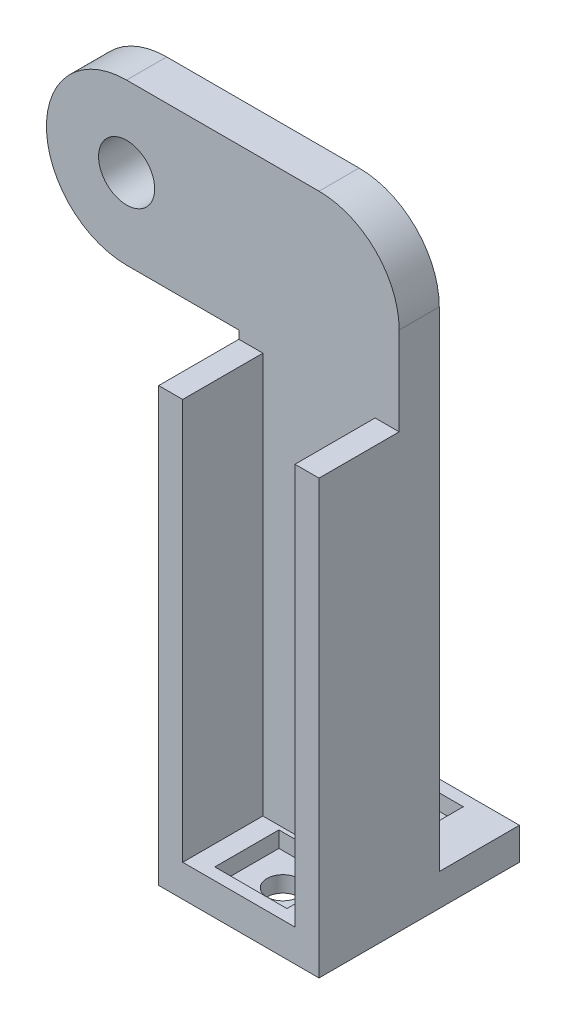
ISO-10303-21;
HEADER;
FILE_DESCRIPTION(('STEP AP214'),'2;1');
FILE_NAME('part.step','',(''),(''),'','','');
FILE_SCHEMA(('AUTOMOTIVE_DESIGN { 1 0 10303 214 1 1 1 1 }'));
ENDSEC;
DATA;
#1=APPLICATION_CONTEXT('core data for automotive mechanical design processes');
#2=APPLICATION_PROTOCOL_DEFINITION('international standard','automotive_design',2000,#1);
#3=PRODUCT_CONTEXT('',#1,'mechanical');
#4=PRODUCT('Part','Part','',(#3));
#5=PRODUCT_RELATED_PRODUCT_CATEGORY('part','',(#4));
#6=PRODUCT_DEFINITION_FORMATION('','',#4);
#7=PRODUCT_DEFINITION_CONTEXT('part definition',#1,'design');
#8=PRODUCT_DEFINITION('design','',#6,#7);
#9=PRODUCT_DEFINITION_SHAPE('','',#8);
#10=(LENGTH_UNIT() NAMED_UNIT(*) SI_UNIT(.MILLI.,.METRE.));
#11=(NAMED_UNIT(*) PLANE_ANGLE_UNIT() SI_UNIT($,.RADIAN.));
#12=(NAMED_UNIT(*) SI_UNIT($,.STERADIAN.) SOLID_ANGLE_UNIT());
#13=UNCERTAINTY_MEASURE_WITH_UNIT(LENGTH_MEASURE(1.E-05),#10,'distance_accuracy_value','');
#14=(GEOMETRIC_REPRESENTATION_CONTEXT(3) GLOBAL_UNCERTAINTY_ASSIGNED_CONTEXT((#13)) GLOBAL_UNIT_ASSIGNED_CONTEXT((#10,
#11,#12)) REPRESENTATION_CONTEXT('',''));
#15=CARTESIAN_POINT('',(0.,0.,0.));
#16=DIRECTION('',(0.,0.,1.));
#17=DIRECTION('',(1.,0.,0.));
#18=AXIS2_PLACEMENT_3D('',#15,#16,#17);
#19=CARTESIAN_POINT('',(0.,0.,2.5));
#20=DIRECTION('',(0.,0.,1.));
#21=DIRECTION('',(1.,0.,0.));
#22=AXIS2_PLACEMENT_3D('',#19,#20,#21);
#23=PLANE('',#22);
#24=DIRECTION('',(0.,-1.,0.));
#25=VECTOR('',#24,1.);
#26=CARTESIAN_POINT('',(3.5,27.,2.5));
#27=LINE('',#26,#25);
#28=CARTESIAN_POINT('',(3.5,27.,2.5));
#29=VERTEX_POINT('',#28);
#30=CARTESIAN_POINT('',(3.5,2.,2.5));
#31=VERTEX_POINT('',#30);
#32=EDGE_CURVE('E58',#29,#31,#27,.T.);
#33=ORIENTED_EDGE('',*,*,#32,.F.);
#34=DIRECTION('',(1.,0.,0.));
#35=VECTOR('',#34,1.);
#36=CARTESIAN_POINT('',(5.,27.,2.5));
#37=LINE('',#36,#35);
#38=CARTESIAN_POINT('',(5.,27.,2.5));
#39=VERTEX_POINT('',#38);
#40=EDGE_CURVE('E211',#29,#39,#37,.T.);
#41=ORIENTED_EDGE('',*,*,#40,.T.);
#42=DIRECTION('',(0.,1.,0.));
#43=VECTOR('',#42,1.);
#44=CARTESIAN_POINT('',(5.,0.,2.5));
#45=LINE('',#44,#43);
#46=CARTESIAN_POINT('',(5.,32.5,2.5));
#47=VERTEX_POINT('',#46);
#48=EDGE_CURVE('E340',#39,#47,#45,.T.);
#49=ORIENTED_EDGE('',*,*,#48,.T.);
#50=CARTESIAN_POINT('',(0.,32.5,2.5));
#51=DIRECTION('',(0.,0.,1.));
#52=DIRECTION('',(1.,0.,0.));
#53=AXIS2_PLACEMENT_3D('',#50,#51,#52);
#54=CIRCLE('',#53,5.);
#55=CARTESIAN_POINT('',(0.,37.5,2.5));
#56=VERTEX_POINT('',#55);
#57=EDGE_CURVE('E342',#47,#56,#54,.T.);
#58=ORIENTED_EDGE('',*,*,#57,.T.);
#59=DIRECTION('',(-1.,0.,0.));
#60=VECTOR('',#59,1.);
#61=CARTESIAN_POINT('',(0.,37.5,2.5));
#62=LINE('',#61,#60);
#63=CARTESIAN_POINT('',(-12.,37.5,2.5));
#64=VERTEX_POINT('',#63);
#65=EDGE_CURVE('E345',#56,#64,#62,.T.);
#66=ORIENTED_EDGE('',*,*,#65,.T.);
#67=CARTESIAN_POINT('',(-12.,32.5,2.5));
#68=DIRECTION('',(0.,0.,1.));
#69=DIRECTION('',(1.,0.,0.));
#70=AXIS2_PLACEMENT_3D('',#67,#68,#69);
#71=CIRCLE('',#70,5.);
#72=CARTESIAN_POINT('',(-12.,27.5,2.5));
#73=VERTEX_POINT('',#72);
#74=EDGE_CURVE('E347',#64,#73,#71,.T.);
#75=ORIENTED_EDGE('',*,*,#74,.T.);
#76=DIRECTION('',(-1.,0.,0.));
#77=VECTOR('',#76,1.);
#78=CARTESIAN_POINT('',(0.,27.5,2.5));
#79=LINE('',#78,#77);
#80=CARTESIAN_POINT('',(-5.,27.5,2.5));
#81=VERTEX_POINT('',#80);
#82=EDGE_CURVE('E349',#81,#73,#79,.T.);
#83=ORIENTED_EDGE('',*,*,#82,.F.);
#84=DIRECTION('',(0.,1.,0.));
#85=VECTOR('',#84,1.);
#86=CARTESIAN_POINT('',(-5.,0.,2.5));
#87=LINE('',#86,#85);
#88=CARTESIAN_POINT('',(-5.,27.,2.5));
#89=VERTEX_POINT('',#88);
#90=EDGE_CURVE('E352',#89,#81,#87,.T.);
#91=ORIENTED_EDGE('',*,*,#90,.F.);
#92=DIRECTION('',(-1.,0.,0.));
#93=VECTOR('',#92,1.);
#94=CARTESIAN_POINT('',(-5.,27.,2.5));
#95=LINE('',#94,#93);
#96=CARTESIAN_POINT('',(-3.5,27.,2.5));
#97=VERTEX_POINT('',#96);
#98=EDGE_CURVE('E233',#97,#89,#95,.T.);
#99=ORIENTED_EDGE('',*,*,#98,.F.);
#100=DIRECTION('',(0.,-1.,0.));
#101=VECTOR('',#100,1.);
#102=CARTESIAN_POINT('',(-3.5,27.,2.5));
#103=LINE('',#102,#101);
#104=CARTESIAN_POINT('',(-3.5,2.,2.5));
#105=VERTEX_POINT('',#104);
#106=EDGE_CURVE('E236',#97,#105,#103,.T.);
#107=ORIENTED_EDGE('',*,*,#106,.T.);
#108=DIRECTION('',(1.,0.,0.));
#109=VECTOR('',#108,1.);
#110=CARTESIAN_POINT('',(0.,2.,2.5));
#111=LINE('',#110,#109);
#112=EDGE_CURVE('E335',#105,#31,#111,.T.);
#113=ORIENTED_EDGE('',*,*,#112,.T.);
#114=EDGE_LOOP('',(#33,#41,#49,#58,#66,#75,#83,#91,#99,#107,#113));
#115=FACE_BOUND('',#114,.T.);
#116=CARTESIAN_POINT('',(-12.,32.5,2.5));
#117=DIRECTION('',(0.,0.,1.));
#118=DIRECTION('',(1.,0.,0.));
#119=AXIS2_PLACEMENT_3D('',#116,#117,#118);
#120=CIRCLE('',#119,1.75);
#121=CARTESIAN_POINT('',(-10.25,32.5,2.5));
#122=VERTEX_POINT('',#121);
#123=EDGE_CURVE('E354',#122,#122,#120,.T.);
#124=ORIENTED_EDGE('',*,*,#123,.F.);
#125=EDGE_LOOP('',(#124));
#126=FACE_BOUND('',#125,.T.);
#127=ADVANCED_FACE('F41',(#115,#126),#23,.T.);
#128=CARTESIAN_POINT('',(0.,2.,-5.));
#129=DIRECTION('',(0.,-1.,0.));
#130=DIRECTION('',(0.,0.,-1.));
#131=AXIS2_PLACEMENT_3D('',#128,#129,#130);
#132=PLANE('',#131);
#133=DIRECTION('',(-1.,0.,0.));
#134=VECTOR('',#133,1.);
#135=CARTESIAN_POINT('',(-2.25,2.,2.75));
#136=LINE('',#135,#134);
#137=CARTESIAN_POINT('',(2.25,2.,2.75));
#138=VERTEX_POINT('',#137);
#139=CARTESIAN_POINT('',(-2.25,2.,2.75));
#140=VERTEX_POINT('',#139);
#141=EDGE_CURVE('E260',#138,#140,#136,.T.);
#142=ORIENTED_EDGE('',*,*,#141,.F.);
#143=DIRECTION('',(0.,0.,-1.));
#144=VECTOR('',#143,1.);
#145=CARTESIAN_POINT('',(2.25,2.,6.75));
#146=LINE('',#145,#144);
#147=CARTESIAN_POINT('',(2.25,2.,6.75));
#148=VERTEX_POINT('',#147);
#149=EDGE_CURVE('E258',#148,#138,#146,.T.);
#150=ORIENTED_EDGE('',*,*,#149,.F.);
#151=DIRECTION('',(1.,0.,0.));
#152=VECTOR('',#151,1.);
#153=CARTESIAN_POINT('',(-2.25,2.,6.75));
#154=LINE('',#153,#152);
#155=CARTESIAN_POINT('',(-2.25,2.,6.75));
#156=VERTEX_POINT('',#155);
#157=EDGE_CURVE('E248',#156,#148,#154,.T.);
#158=ORIENTED_EDGE('',*,*,#157,.F.);
#159=DIRECTION('',(0.,0.,1.));
#160=VECTOR('',#159,1.);
#161=CARTESIAN_POINT('',(-2.25,2.,6.75));
#162=LINE('',#161,#160);
#163=EDGE_CURVE('E264',#140,#156,#162,.T.);
#164=ORIENTED_EDGE('',*,*,#163,.F.);
#165=EDGE_LOOP('',(#142,#150,#158,#164));
#166=FACE_BOUND('',#165,.T.);
#167=DIRECTION('',(1.,0.,0.));
#168=VECTOR('',#167,1.);
#169=CARTESIAN_POINT('',(0.,2.,7.5));
#170=LINE('',#169,#168);
#171=CARTESIAN_POINT('',(-3.5,2.,7.5));
#172=VERTEX_POINT('',#171);
#173=CARTESIAN_POINT('',(3.5,2.,7.5));
#174=VERTEX_POINT('',#173);
#175=EDGE_CURVE('E311',#172,#174,#170,.T.);
#176=ORIENTED_EDGE('',*,*,#175,.T.);
#177=DIRECTION('',(0.,0.,-1.));
#178=VECTOR('',#177,1.);
#179=CARTESIAN_POINT('',(3.5,2.,2.5));
#180=LINE('',#179,#178);
#181=EDGE_CURVE('E66',#174,#31,#180,.T.);
#182=ORIENTED_EDGE('',*,*,#181,.T.);
#183=ORIENTED_EDGE('',*,*,#112,.F.);
#184=DIRECTION('',(0.,0.,-1.));
#185=VECTOR('',#184,1.);
#186=CARTESIAN_POINT('',(-3.5,2.,2.5));
#187=LINE('',#186,#185);
#188=EDGE_CURVE('E224',#172,#105,#187,.T.);
#189=ORIENTED_EDGE('',*,*,#188,.F.);
#190=EDGE_LOOP('',(#176,#182,#183,#189));
#191=FACE_BOUND('',#190,.T.);
#192=ADVANCED_FACE('F416',(#166,#191),#132,.F.);
#193=CARTESIAN_POINT('',(0.,0.,0.));
#194=DIRECTION('',(0.,0.,1.));
#195=DIRECTION('',(1.,0.,0.));
#196=AXIS2_PLACEMENT_3D('',#193,#194,#195);
#197=PLANE('',#196);
#198=CARTESIAN_POINT('',(-12.,32.5,0.));
#199=DIRECTION('',(0.,0.,1.));
#200=DIRECTION('',(1.,0.,0.));
#201=AXIS2_PLACEMENT_3D('',#198,#199,#200);
#202=CIRCLE('',#201,1.75);
#203=CARTESIAN_POINT('',(-10.25,32.5,0.));
#204=VERTEX_POINT('',#203);
#205=EDGE_CURVE('E343',#204,#204,#202,.T.);
#206=ORIENTED_EDGE('',*,*,#205,.T.);
#207=EDGE_LOOP('',(#206));
#208=FACE_BOUND('',#207,.T.);
#209=DIRECTION('',(1.,0.,0.));
#210=VECTOR('',#209,1.);
#211=CARTESIAN_POINT('',(0.,2.,0.));
#212=LINE('',#211,#210);
#213=CARTESIAN_POINT('',(-5.,2.,0.));
#214=VERTEX_POINT('',#213);
#215=CARTESIAN_POINT('',(5.,2.,0.));
#216=VERTEX_POINT('',#215);
#217=EDGE_CURVE('E11',#214,#216,#212,.T.);
#218=ORIENTED_EDGE('',*,*,#217,.F.);
#219=DIRECTION('',(0.,1.,0.));
#220=VECTOR('',#219,1.);
#221=CARTESIAN_POINT('',(-5.,0.,0.));
#222=LINE('',#221,#220);
#223=CARTESIAN_POINT('',(-5.,27.5,0.));
#224=VERTEX_POINT('',#223);
#225=EDGE_CURVE('E369',#214,#224,#222,.T.);
#226=ORIENTED_EDGE('',*,*,#225,.T.);
#227=DIRECTION('',(-1.,0.,0.));
#228=VECTOR('',#227,1.);
#229=CARTESIAN_POINT('',(0.,27.5,0.));
#230=LINE('',#229,#228);
#231=CARTESIAN_POINT('',(-12.,27.5,0.));
#232=VERTEX_POINT('',#231);
#233=EDGE_CURVE('E366',#224,#232,#230,.T.);
#234=ORIENTED_EDGE('',*,*,#233,.T.);
#235=CARTESIAN_POINT('',(-12.,32.5,0.));
#236=DIRECTION('',(0.,0.,1.));
#237=DIRECTION('',(1.,0.,0.));
#238=AXIS2_PLACEMENT_3D('',#235,#236,#237);
#239=CIRCLE('',#238,5.);
#240=CARTESIAN_POINT('',(-12.,37.5,0.));
#241=VERTEX_POINT('',#240);
#242=EDGE_CURVE('E363',#241,#232,#239,.T.);
#243=ORIENTED_EDGE('',*,*,#242,.F.);
#244=DIRECTION('',(-1.,0.,0.));
#245=VECTOR('',#244,1.);
#246=CARTESIAN_POINT('',(0.,37.5,0.));
#247=LINE('',#246,#245);
#248=CARTESIAN_POINT('',(0.,37.5,0.));
#249=VERTEX_POINT('',#248);
#250=EDGE_CURVE('E361',#249,#241,#247,.T.);
#251=ORIENTED_EDGE('',*,*,#250,.F.);
#252=CARTESIAN_POINT('',(0.,32.5,0.));
#253=DIRECTION('',(0.,0.,1.));
#254=DIRECTION('',(1.,0.,0.));
#255=AXIS2_PLACEMENT_3D('',#252,#253,#254);
#256=CIRCLE('',#255,5.);
#257=CARTESIAN_POINT('',(5.,32.5,0.));
#258=VERTEX_POINT('',#257);
#259=EDGE_CURVE('E359',#258,#249,#256,.T.);
#260=ORIENTED_EDGE('',*,*,#259,.F.);
#261=DIRECTION('',(0.,1.,0.));
#262=VECTOR('',#261,1.);
#263=CARTESIAN_POINT('',(5.,0.,0.));
#264=LINE('',#263,#262);
#265=EDGE_CURVE('E339',#216,#258,#264,.T.);
#266=ORIENTED_EDGE('',*,*,#265,.F.);
#267=EDGE_LOOP('',(#218,#226,#234,#243,#251,#260,#266));
#268=FACE_BOUND('',#267,.T.);
#269=ADVANCED_FACE('F422',(#208,#268),#197,.F.);
#270=CARTESIAN_POINT('',(5.,0.,2.5));
#271=DIRECTION('',(-1.,0.,0.));
#272=DIRECTION('',(0.,0.,1.));
#273=AXIS2_PLACEMENT_3D('',#270,#271,#272);
#274=PLANE('',#273);
#275=ORIENTED_EDGE('',*,*,#48,.F.);
#276=DIRECTION('',(0.,0.,1.));
#277=VECTOR('',#276,1.);
#278=CARTESIAN_POINT('',(5.,27.,2.5));
#279=LINE('',#278,#277);
#280=CARTESIAN_POINT('',(5.,27.,7.5));
#281=VERTEX_POINT('',#280);
#282=EDGE_CURVE('E221',#39,#281,#279,.T.);
#283=ORIENTED_EDGE('',*,*,#282,.T.);
#284=DIRECTION('',(0.,1.,0.));
#285=VECTOR('',#284,1.);
#286=CARTESIAN_POINT('',(5.,0.,7.5));
#287=LINE('',#286,#285);
#288=CARTESIAN_POINT('',(5.,0.,7.5));
#289=VERTEX_POINT('',#288);
#290=EDGE_CURVE('E216',#289,#281,#287,.T.);
#291=ORIENTED_EDGE('',*,*,#290,.F.);
#292=DIRECTION('',(0.,0.,-1.));
#293=VECTOR('',#292,1.);
#294=CARTESIAN_POINT('',(5.,0.,2.5));
#295=LINE('',#294,#293);
#296=CARTESIAN_POINT('',(5.,0.,-5.));
#297=VERTEX_POINT('',#296);
#298=EDGE_CURVE('E357',#289,#297,#295,.T.);
#299=ORIENTED_EDGE('',*,*,#298,.T.);
#300=DIRECTION('',(0.,1.,0.));
#301=VECTOR('',#300,1.);
#302=CARTESIAN_POINT('',(5.,0.,-5.));
#303=LINE('',#302,#301);
#304=CARTESIAN_POINT('',(5.,2.,-5.));
#305=VERTEX_POINT('',#304);
#306=EDGE_CURVE('E328',#297,#305,#303,.T.);
#307=ORIENTED_EDGE('',*,*,#306,.T.);
#308=DIRECTION('',(0.,0.,1.));
#309=VECTOR('',#308,1.);
#310=CARTESIAN_POINT('',(5.,2.,-5.));
#311=LINE('',#310,#309);
#312=EDGE_CURVE('E332',#305,#216,#311,.T.);
#313=ORIENTED_EDGE('',*,*,#312,.T.);
#314=ORIENTED_EDGE('',*,*,#265,.T.);
#315=DIRECTION('',(0.,0.,-1.));
#316=VECTOR('',#315,1.);
#317=CARTESIAN_POINT('',(5.,32.5,2.5));
#318=LINE('',#317,#316);
#319=EDGE_CURVE('E50',#47,#258,#318,.T.);
#320=ORIENTED_EDGE('',*,*,#319,.F.);
#321=EDGE_LOOP('',(#275,#283,#291,#299,#307,#313,#314,#320));
#322=FACE_BOUND('',#321,.T.);
#323=ADVANCED_FACE('F43',(#322),#274,.F.);
#324=CARTESIAN_POINT('',(0.,32.5,2.5));
#325=DIRECTION('',(0.,0.,-1.));
#326=DIRECTION('',(-1.,0.,0.));
#327=AXIS2_PLACEMENT_3D('',#324,#325,#326);
#328=CYLINDRICAL_SURFACE('',#327,5.);
#329=ORIENTED_EDGE('',*,*,#259,.T.);
#330=DIRECTION('',(0.,0.,-1.));
#331=VECTOR('',#330,1.);
#332=CARTESIAN_POINT('',(0.,37.5,2.5));
#333=LINE('',#332,#331);
#334=EDGE_CURVE('E384',#56,#249,#333,.T.);
#335=ORIENTED_EDGE('',*,*,#334,.F.);
#336=ORIENTED_EDGE('',*,*,#57,.F.);
#337=ORIENTED_EDGE('',*,*,#319,.T.);
#338=EDGE_LOOP('',(#329,#335,#336,#337));
#339=FACE_BOUND('',#338,.T.);
#340=ADVANCED_FACE('F455',(#339),#328,.T.);
#341=CARTESIAN_POINT('',(0.,37.5,2.5));
#342=DIRECTION('',(0.,-1.,0.));
#343=DIRECTION('',(0.,0.,-1.));
#344=AXIS2_PLACEMENT_3D('',#341,#342,#343);
#345=PLANE('',#344);
#346=ORIENTED_EDGE('',*,*,#250,.T.);
#347=DIRECTION('',(0.,0.,-1.));
#348=VECTOR('',#347,1.);
#349=CARTESIAN_POINT('',(-12.,37.5,2.5));
#350=LINE('',#349,#348);
#351=EDGE_CURVE('E381',#64,#241,#350,.T.);
#352=ORIENTED_EDGE('',*,*,#351,.F.);
#353=ORIENTED_EDGE('',*,*,#65,.F.);
#354=ORIENTED_EDGE('',*,*,#334,.T.);
#355=EDGE_LOOP('',(#346,#352,#353,#354));
#356=FACE_BOUND('',#355,.T.);
#357=ADVANCED_FACE('F452',(#356),#345,.F.);
#358=CARTESIAN_POINT('',(-12.,32.5,2.5));
#359=DIRECTION('',(0.,0.,-1.));
#360=DIRECTION('',(-1.,0.,0.));
#361=AXIS2_PLACEMENT_3D('',#358,#359,#360);
#362=CYLINDRICAL_SURFACE('',#361,5.);
#363=ORIENTED_EDGE('',*,*,#242,.T.);
#364=DIRECTION('',(0.,0.,-1.));
#365=VECTOR('',#364,1.);
#366=CARTESIAN_POINT('',(-12.,27.5,2.5));
#367=LINE('',#366,#365);
#368=EDGE_CURVE('E379',#73,#232,#367,.T.);
#369=ORIENTED_EDGE('',*,*,#368,.F.);
#370=ORIENTED_EDGE('',*,*,#74,.F.);
#371=ORIENTED_EDGE('',*,*,#351,.T.);
#372=EDGE_LOOP('',(#363,#369,#370,#371));
#373=FACE_BOUND('',#372,.T.);
#374=ADVANCED_FACE('F448',(#373),#362,.T.);
#375=CARTESIAN_POINT('',(0.,27.5,2.5));
#376=DIRECTION('',(0.,-1.,0.));
#377=DIRECTION('',(0.,0.,-1.));
#378=AXIS2_PLACEMENT_3D('',#375,#376,#377);
#379=PLANE('',#378);
#380=ORIENTED_EDGE('',*,*,#233,.F.);
#381=DIRECTION('',(0.,0.,-1.));
#382=VECTOR('',#381,1.);
#383=CARTESIAN_POINT('',(-5.,27.5,2.5));
#384=LINE('',#383,#382);
#385=EDGE_CURVE('E376',#81,#224,#384,.T.);
#386=ORIENTED_EDGE('',*,*,#385,.F.);
#387=ORIENTED_EDGE('',*,*,#82,.T.);
#388=ORIENTED_EDGE('',*,*,#368,.T.);
#389=EDGE_LOOP('',(#380,#386,#387,#388));
#390=FACE_BOUND('',#389,.T.);
#391=ADVANCED_FACE('F444',(#390),#379,.T.);
#392=CARTESIAN_POINT('',(-5.,0.,2.5));
#393=DIRECTION('',(-1.,0.,0.));
#394=DIRECTION('',(0.,0.,1.));
#395=AXIS2_PLACEMENT_3D('',#392,#393,#394);
#396=PLANE('',#395);
#397=DIRECTION('',(0.,0.,1.));
#398=VECTOR('',#397,1.);
#399=CARTESIAN_POINT('',(-5.,27.,2.5));
#400=LINE('',#399,#398);
#401=CARTESIAN_POINT('',(-5.,27.,7.5));
#402=VERTEX_POINT('',#401);
#403=EDGE_CURVE('E225',#89,#402,#400,.T.);
#404=ORIENTED_EDGE('',*,*,#403,.F.);
#405=ORIENTED_EDGE('',*,*,#90,.T.);
#406=ORIENTED_EDGE('',*,*,#385,.T.);
#407=ORIENTED_EDGE('',*,*,#225,.F.);
#408=DIRECTION('',(0.,0.,1.));
#409=VECTOR('',#408,1.);
#410=CARTESIAN_POINT('',(-5.,2.,-5.));
#411=LINE('',#410,#409);
#412=CARTESIAN_POINT('',(-5.,2.,-5.));
#413=VERTEX_POINT('',#412);
#414=EDGE_CURVE('E331',#413,#214,#411,.T.);
#415=ORIENTED_EDGE('',*,*,#414,.F.);
#416=DIRECTION('',(0.,1.,0.));
#417=VECTOR('',#416,1.);
#418=CARTESIAN_POINT('',(-5.,0.,-5.));
#419=LINE('',#418,#417);
#420=CARTESIAN_POINT('',(-5.,0.,-5.));
#421=VERTEX_POINT('',#420);
#422=EDGE_CURVE('E323',#421,#413,#419,.T.);
#423=ORIENTED_EDGE('',*,*,#422,.F.);
#424=DIRECTION('',(0.,0.,-1.));
#425=VECTOR('',#424,1.);
#426=CARTESIAN_POINT('',(-5.,0.,2.5));
#427=LINE('',#426,#425);
#428=CARTESIAN_POINT('',(-5.,0.,7.5));
#429=VERTEX_POINT('',#428);
#430=EDGE_CURVE('E374',#429,#421,#427,.T.);
#431=ORIENTED_EDGE('',*,*,#430,.F.);
#432=DIRECTION('',(0.,1.,0.));
#433=VECTOR('',#432,1.);
#434=CARTESIAN_POINT('',(-5.,0.,7.5));
#435=LINE('',#434,#433);
#436=EDGE_CURVE('E316',#429,#402,#435,.T.);
#437=ORIENTED_EDGE('',*,*,#436,.T.);
#438=EDGE_LOOP('',(#404,#405,#406,#407,#415,#423,#431,#437));
#439=FACE_BOUND('',#438,.T.);
#440=ADVANCED_FACE('F440',(#439),#396,.T.);
#441=CARTESIAN_POINT('',(0.,0.,2.5));
#442=DIRECTION('',(0.,1.,0.));
#443=DIRECTION('',(0.,0.,1.));
#444=AXIS2_PLACEMENT_3D('',#441,#442,#443);
#445=PLANE('',#444);
#446=CARTESIAN_POINT('',(0.,0.,-2.25));
#447=DIRECTION('',(0.,1.,0.));
#448=DIRECTION('',(0.,0.,1.));
#449=AXIS2_PLACEMENT_3D('',#446,#447,#448);
#450=CIRCLE('',#449,1.);
#451=CARTESIAN_POINT('',(0.,0.,-1.25));
#452=VERTEX_POINT('',#451);
#453=EDGE_CURVE('E308',#452,#452,#450,.T.);
#454=ORIENTED_EDGE('',*,*,#453,.T.);
#455=EDGE_LOOP('',(#454));
#456=FACE_BOUND('',#455,.T.);
#457=CARTESIAN_POINT('',(0.,0.,4.75));
#458=DIRECTION('',(0.,1.,0.));
#459=DIRECTION('',(0.,0.,1.));
#460=AXIS2_PLACEMENT_3D('',#457,#458,#459);
#461=CIRCLE('',#460,1.);
#462=CARTESIAN_POINT('',(0.,0.,5.75));
#463=VERTEX_POINT('',#462);
#464=EDGE_CURVE('E312',#463,#463,#461,.T.);
#465=ORIENTED_EDGE('',*,*,#464,.T.);
#466=EDGE_LOOP('',(#465));
#467=FACE_BOUND('',#466,.T.);
#468=ORIENTED_EDGE('',*,*,#430,.T.);
#469=DIRECTION('',(1.,0.,0.));
#470=VECTOR('',#469,1.);
#471=CARTESIAN_POINT('',(0.,0.,-5.));
#472=LINE('',#471,#470);
#473=EDGE_CURVE('E325',#421,#297,#472,.T.);
#474=ORIENTED_EDGE('',*,*,#473,.T.);
#475=ORIENTED_EDGE('',*,*,#298,.F.);
#476=DIRECTION('',(1.,0.,0.));
#477=VECTOR('',#476,1.);
#478=CARTESIAN_POINT('',(0.,0.,7.5));
#479=LINE('',#478,#477);
#480=EDGE_CURVE('E318',#429,#289,#479,.T.);
#481=ORIENTED_EDGE('',*,*,#480,.F.);
#482=EDGE_LOOP('',(#468,#474,#475,#481));
#483=FACE_BOUND('',#482,.T.);
#484=ADVANCED_FACE('F436',(#456,#467,#483),#445,.F.);
#485=CARTESIAN_POINT('',(-12.,32.5,2.5));
#486=DIRECTION('',(0.,0.,-1.));
#487=DIRECTION('',(-1.,0.,0.));
#488=AXIS2_PLACEMENT_3D('',#485,#486,#487);
#489=CYLINDRICAL_SURFACE('',#488,1.75);
#490=ORIENTED_EDGE('',*,*,#123,.T.);
#491=EDGE_LOOP('',(#490));
#492=FACE_BOUND('',#491,.T.);
#493=ORIENTED_EDGE('',*,*,#205,.F.);
#494=EDGE_LOOP('',(#493));
#495=FACE_BOUND('',#494,.T.);
#496=ADVANCED_FACE('F432',(#492,#495),#489,.F.);
#497=CARTESIAN_POINT('',(0.,0.,-5.));
#498=DIRECTION('',(0.,0.,1.));
#499=DIRECTION('',(1.,0.,0.));
#500=AXIS2_PLACEMENT_3D('',#497,#498,#499);
#501=PLANE('',#500);
#502=DIRECTION('',(1.,0.,0.));
#503=VECTOR('',#502,1.);
#504=CARTESIAN_POINT('',(0.,2.,-5.));
#505=LINE('',#504,#503);
#506=EDGE_CURVE('E321',#413,#305,#505,.T.);
#507=ORIENTED_EDGE('',*,*,#506,.T.);
#508=ORIENTED_EDGE('',*,*,#306,.F.);
#509=ORIENTED_EDGE('',*,*,#473,.F.);
#510=ORIENTED_EDGE('',*,*,#422,.T.);
#511=EDGE_LOOP('',(#507,#508,#509,#510));
#512=FACE_BOUND('',#511,.T.);
#513=ADVANCED_FACE('F435',(#512),#501,.F.);
#514=DIRECTION('',(-1.,0.,0.));
#515=VECTOR('',#514,1.);
#516=CARTESIAN_POINT('',(-2.25,2.,-4.25));
#517=LINE('',#516,#515);
#518=CARTESIAN_POINT('',(2.25,2.,-4.25));
#519=VERTEX_POINT('',#518);
#520=CARTESIAN_POINT('',(-2.25,2.,-4.25));
#521=VERTEX_POINT('',#520);
#522=EDGE_CURVE('E294',#519,#521,#517,.T.);
#523=ORIENTED_EDGE('',*,*,#522,.F.);
#524=DIRECTION('',(0.,0.,-1.));
#525=VECTOR('',#524,1.);
#526=CARTESIAN_POINT('',(2.25,2.,-0.25));
#527=LINE('',#526,#525);
#528=CARTESIAN_POINT('',(2.25,2.,-0.25));
#529=VERTEX_POINT('',#528);
#530=EDGE_CURVE('E261',#529,#519,#527,.T.);
#531=ORIENTED_EDGE('',*,*,#530,.F.);
#532=DIRECTION('',(1.,0.,0.));
#533=VECTOR('',#532,1.);
#534=CARTESIAN_POINT('',(-2.25,2.,-0.25));
#535=LINE('',#534,#533);
#536=CARTESIAN_POINT('',(-2.25,2.,-0.25));
#537=VERTEX_POINT('',#536);
#538=EDGE_CURVE('E287',#537,#529,#535,.T.);
#539=ORIENTED_EDGE('',*,*,#538,.F.);
#540=DIRECTION('',(0.,0.,1.));
#541=VECTOR('',#540,1.);
#542=CARTESIAN_POINT('',(-2.25,2.,-0.25));
#543=LINE('',#542,#541);
#544=EDGE_CURVE('E290',#521,#537,#543,.T.);
#545=ORIENTED_EDGE('',*,*,#544,.F.);
#546=EDGE_LOOP('',(#523,#531,#539,#545));
#547=FACE_BOUND('',#546,.T.);
#548=ORIENTED_EDGE('',*,*,#414,.T.);
#549=ORIENTED_EDGE('',*,*,#217,.T.);
#550=ORIENTED_EDGE('',*,*,#312,.F.);
#551=ORIENTED_EDGE('',*,*,#506,.F.);
#552=EDGE_LOOP('',(#548,#549,#550,#551));
#553=FACE_BOUND('',#552,.T.);
#554=ADVANCED_FACE('F425',(#547,#553),#132,.F.);
#555=CARTESIAN_POINT('',(0.,0.,7.5));
#556=DIRECTION('',(0.,0.,1.));
#557=DIRECTION('',(1.,0.,0.));
#558=AXIS2_PLACEMENT_3D('',#555,#556,#557);
#559=PLANE('',#558);
#560=ORIENTED_EDGE('',*,*,#175,.F.);
#561=DIRECTION('',(0.,-1.,0.));
#562=VECTOR('',#561,1.);
#563=CARTESIAN_POINT('',(-3.5,27.,7.5));
#564=LINE('',#563,#562);
#565=CARTESIAN_POINT('',(-3.5,27.,7.5));
#566=VERTEX_POINT('',#565);
#567=EDGE_CURVE('E240',#566,#172,#564,.T.);
#568=ORIENTED_EDGE('',*,*,#567,.F.);
#569=DIRECTION('',(1.,0.,0.));
#570=VECTOR('',#569,1.);
#571=CARTESIAN_POINT('',(-5.,27.,7.5));
#572=LINE('',#571,#570);
#573=EDGE_CURVE('E228',#402,#566,#572,.T.);
#574=ORIENTED_EDGE('',*,*,#573,.F.);
#575=ORIENTED_EDGE('',*,*,#436,.F.);
#576=ORIENTED_EDGE('',*,*,#480,.T.);
#577=ORIENTED_EDGE('',*,*,#290,.T.);
#578=DIRECTION('',(-1.,0.,0.));
#579=VECTOR('',#578,1.);
#580=CARTESIAN_POINT('',(5.,27.,7.5));
#581=LINE('',#580,#579);
#582=CARTESIAN_POINT('',(3.5,27.,7.5));
#583=VERTEX_POINT('',#582);
#584=EDGE_CURVE('E205',#281,#583,#581,.T.);
#585=ORIENTED_EDGE('',*,*,#584,.T.);
#586=DIRECTION('',(0.,-1.,0.));
#587=VECTOR('',#586,1.);
#588=CARTESIAN_POINT('',(3.5,27.,7.5));
#589=LINE('',#588,#587);
#590=EDGE_CURVE('E199',#583,#174,#589,.T.);
#591=ORIENTED_EDGE('',*,*,#590,.T.);
#592=EDGE_LOOP('',(#560,#568,#574,#575,#576,#577,#585,#591));
#593=FACE_BOUND('',#592,.T.);
#594=ADVANCED_FACE('F213',(#593),#559,.T.);
#595=CARTESIAN_POINT('',(0.,0.,4.75));
#596=DIRECTION('',(0.,1.,0.));
#597=DIRECTION('',(0.,0.,1.));
#598=AXIS2_PLACEMENT_3D('',#595,#596,#597);
#599=CYLINDRICAL_SURFACE('',#598,1.);
#600=CARTESIAN_POINT('',(0.,1.,4.75));
#601=DIRECTION('',(0.,-1.,0.));
#602=DIRECTION('',(0.,0.,-1.));
#603=AXIS2_PLACEMENT_3D('',#600,#601,#602);
#604=CIRCLE('',#603,1.);
#605=CARTESIAN_POINT('',(0.,1.,3.75));
#606=VERTEX_POINT('',#605);
#607=EDGE_CURVE('E45',#606,#606,#604,.F.);
#608=ORIENTED_EDGE('',*,*,#607,.T.);
#609=EDGE_LOOP('',(#608));
#610=FACE_BOUND('',#609,.T.);
#611=ORIENTED_EDGE('',*,*,#464,.F.);
#612=EDGE_LOOP('',(#611));
#613=FACE_BOUND('',#612,.T.);
#614=ADVANCED_FACE('F394',(#610,#613),#599,.F.);
#615=CARTESIAN_POINT('',(0.,0.,-2.25));
#616=DIRECTION('',(0.,1.,0.));
#617=DIRECTION('',(0.,0.,1.));
#618=AXIS2_PLACEMENT_3D('',#615,#616,#617);
#619=CYLINDRICAL_SURFACE('',#618,1.);
#620=CARTESIAN_POINT('',(0.,1.,-2.25));
#621=DIRECTION('',(0.,-1.,0.));
#622=DIRECTION('',(0.,0.,-1.));
#623=AXIS2_PLACEMENT_3D('',#620,#621,#622);
#624=CIRCLE('',#623,1.);
#625=CARTESIAN_POINT('',(0.,1.,-3.25));
#626=VERTEX_POINT('',#625);
#627=EDGE_CURVE('E271',#626,#626,#624,.F.);
#628=ORIENTED_EDGE('',*,*,#627,.T.);
#629=EDGE_LOOP('',(#628));
#630=FACE_BOUND('',#629,.T.);
#631=ORIENTED_EDGE('',*,*,#453,.F.);
#632=EDGE_LOOP('',(#631));
#633=FACE_BOUND('',#632,.T.);
#634=ADVANCED_FACE('F511',(#630,#633),#619,.F.);
#635=CARTESIAN_POINT('',(0.,1.,0.));
#636=DIRECTION('',(0.,-1.,0.));
#637=DIRECTION('',(0.,0.,-1.));
#638=AXIS2_PLACEMENT_3D('',#635,#636,#637);
#639=PLANE('',#638);
#640=DIRECTION('',(0.,0.,-1.));
#641=VECTOR('',#640,1.);
#642=CARTESIAN_POINT('',(2.25,1.,-0.25));
#643=LINE('',#642,#641);
#644=CARTESIAN_POINT('',(2.25,1.,-0.25));
#645=VERTEX_POINT('',#644);
#646=CARTESIAN_POINT('',(2.25,1.,-4.25));
#647=VERTEX_POINT('',#646);
#648=EDGE_CURVE('E291',#645,#647,#643,.T.);
#649=ORIENTED_EDGE('',*,*,#648,.T.);
#650=DIRECTION('',(-1.,0.,0.));
#651=VECTOR('',#650,1.);
#652=CARTESIAN_POINT('',(-2.25,1.,-4.25));
#653=LINE('',#652,#651);
#654=CARTESIAN_POINT('',(-2.25,1.,-4.25));
#655=VERTEX_POINT('',#654);
#656=EDGE_CURVE('E303',#647,#655,#653,.T.);
#657=ORIENTED_EDGE('',*,*,#656,.T.);
#658=DIRECTION('',(0.,0.,1.));
#659=VECTOR('',#658,1.);
#660=CARTESIAN_POINT('',(-2.25,1.,-0.25));
#661=LINE('',#660,#659);
#662=CARTESIAN_POINT('',(-2.25,1.,-0.25));
#663=VERTEX_POINT('',#662);
#664=EDGE_CURVE('E300',#655,#663,#661,.T.);
#665=ORIENTED_EDGE('',*,*,#664,.T.);
#666=DIRECTION('',(1.,0.,0.));
#667=VECTOR('',#666,1.);
#668=CARTESIAN_POINT('',(-2.25,1.,-0.25));
#669=LINE('',#668,#667);
#670=EDGE_CURVE('E281',#663,#645,#669,.T.);
#671=ORIENTED_EDGE('',*,*,#670,.T.);
#672=EDGE_LOOP('',(#649,#657,#665,#671));
#673=FACE_BOUND('',#672,.T.);
#674=ORIENTED_EDGE('',*,*,#627,.F.);
#675=EDGE_LOOP('',(#674));
#676=FACE_BOUND('',#675,.T.);
#677=ADVANCED_FACE('F514',(#673,#676),#639,.F.);
#678=CARTESIAN_POINT('',(2.25,1.,-0.25));
#679=DIRECTION('',(1.,0.,0.));
#680=DIRECTION('',(0.,0.,-1.));
#681=AXIS2_PLACEMENT_3D('',#678,#679,#680);
#682=PLANE('',#681);
#683=ORIENTED_EDGE('',*,*,#530,.T.);
#684=DIRECTION('',(0.,1.,0.));
#685=VECTOR('',#684,1.);
#686=CARTESIAN_POINT('',(2.25,1.,-4.25));
#687=LINE('',#686,#685);
#688=EDGE_CURVE('E278',#647,#519,#687,.T.);
#689=ORIENTED_EDGE('',*,*,#688,.F.);
#690=ORIENTED_EDGE('',*,*,#648,.F.);
#691=DIRECTION('',(0.,1.,0.));
#692=VECTOR('',#691,1.);
#693=CARTESIAN_POINT('',(2.25,1.,-0.25));
#694=LINE('',#693,#692);
#695=EDGE_CURVE('E243',#645,#529,#694,.T.);
#696=ORIENTED_EDGE('',*,*,#695,.T.);
#697=EDGE_LOOP('',(#683,#689,#690,#696));
#698=FACE_BOUND('',#697,.T.);
#699=ADVANCED_FACE('F517',(#698),#682,.F.);
#700=CARTESIAN_POINT('',(-2.25,1.,-0.25));
#701=DIRECTION('',(0.,0.,1.));
#702=DIRECTION('',(1.,0.,0.));
#703=AXIS2_PLACEMENT_3D('',#700,#701,#702);
#704=PLANE('',#703);
#705=ORIENTED_EDGE('',*,*,#538,.T.);
#706=ORIENTED_EDGE('',*,*,#695,.F.);
#707=ORIENTED_EDGE('',*,*,#670,.F.);
#708=DIRECTION('',(0.,1.,0.));
#709=VECTOR('',#708,1.);
#710=CARTESIAN_POINT('',(-2.25,1.,-0.25));
#711=LINE('',#710,#709);
#712=EDGE_CURVE('E284',#663,#537,#711,.T.);
#713=ORIENTED_EDGE('',*,*,#712,.T.);
#714=EDGE_LOOP('',(#705,#706,#707,#713));
#715=FACE_BOUND('',#714,.T.);
#716=ADVANCED_FACE('F519',(#715),#704,.F.);
#717=CARTESIAN_POINT('',(-2.25,1.,-0.25));
#718=DIRECTION('',(-1.,0.,0.));
#719=DIRECTION('',(0.,0.,1.));
#720=AXIS2_PLACEMENT_3D('',#717,#718,#719);
#721=PLANE('',#720);
#722=ORIENTED_EDGE('',*,*,#544,.T.);
#723=ORIENTED_EDGE('',*,*,#712,.F.);
#724=ORIENTED_EDGE('',*,*,#664,.F.);
#725=DIRECTION('',(0.,1.,0.));
#726=VECTOR('',#725,1.);
#727=CARTESIAN_POINT('',(-2.25,1.,-4.25));
#728=LINE('',#727,#726);
#729=EDGE_CURVE('E282',#655,#521,#728,.T.);
#730=ORIENTED_EDGE('',*,*,#729,.T.);
#731=EDGE_LOOP('',(#722,#723,#724,#730));
#732=FACE_BOUND('',#731,.T.);
#733=ADVANCED_FACE('F410',(#732),#721,.F.);
#734=CARTESIAN_POINT('',(-2.25,1.,-4.25));
#735=DIRECTION('',(0.,0.,-1.));
#736=DIRECTION('',(-1.,0.,0.));
#737=AXIS2_PLACEMENT_3D('',#734,#735,#736);
#738=PLANE('',#737);
#739=ORIENTED_EDGE('',*,*,#522,.T.);
#740=ORIENTED_EDGE('',*,*,#729,.F.);
#741=ORIENTED_EDGE('',*,*,#656,.F.);
#742=ORIENTED_EDGE('',*,*,#688,.T.);
#743=EDGE_LOOP('',(#739,#740,#741,#742));
#744=FACE_BOUND('',#743,.T.);
#745=ADVANCED_FACE('F400',(#744),#738,.F.);
#746=CARTESIAN_POINT('',(0.,1.,0.));
#747=DIRECTION('',(0.,-1.,0.));
#748=DIRECTION('',(0.,0.,-1.));
#749=AXIS2_PLACEMENT_3D('',#746,#747,#748);
#750=PLANE('',#749);
#751=DIRECTION('',(0.,0.,-1.));
#752=VECTOR('',#751,1.);
#753=CARTESIAN_POINT('',(2.25,1.,6.75));
#754=LINE('',#753,#752);
#755=CARTESIAN_POINT('',(2.25,1.,6.75));
#756=VERTEX_POINT('',#755);
#757=CARTESIAN_POINT('',(2.25,1.,2.75));
#758=VERTEX_POINT('',#757);
#759=EDGE_CURVE('E244',#756,#758,#754,.T.);
#760=ORIENTED_EDGE('',*,*,#759,.T.);
#761=DIRECTION('',(-1.,0.,0.));
#762=VECTOR('',#761,1.);
#763=CARTESIAN_POINT('',(-2.25,1.,2.75));
#764=LINE('',#763,#762);
#765=CARTESIAN_POINT('',(-2.25,1.,2.75));
#766=VERTEX_POINT('',#765);
#767=EDGE_CURVE('E247',#758,#766,#764,.T.);
#768=ORIENTED_EDGE('',*,*,#767,.T.);
#769=DIRECTION('',(0.,0.,1.));
#770=VECTOR('',#769,1.);
#771=CARTESIAN_POINT('',(-2.25,1.,6.75));
#772=LINE('',#771,#770);
#773=CARTESIAN_POINT('',(-2.25,1.,6.75));
#774=VERTEX_POINT('',#773);
#775=EDGE_CURVE('E251',#766,#774,#772,.T.);
#776=ORIENTED_EDGE('',*,*,#775,.T.);
#777=DIRECTION('',(1.,0.,0.));
#778=VECTOR('',#777,1.);
#779=CARTESIAN_POINT('',(-2.25,1.,6.75));
#780=LINE('',#779,#778);
#781=EDGE_CURVE('E254',#774,#756,#780,.T.);
#782=ORIENTED_EDGE('',*,*,#781,.T.);
#783=EDGE_LOOP('',(#760,#768,#776,#782));
#784=FACE_BOUND('',#783,.T.);
#785=ORIENTED_EDGE('',*,*,#607,.F.);
#786=EDGE_LOOP('',(#785));
#787=FACE_BOUND('',#786,.T.);
#788=ADVANCED_FACE('F397',(#784,#787),#750,.F.);
#789=CARTESIAN_POINT('',(2.25,1.,6.75));
#790=DIRECTION('',(1.,0.,0.));
#791=DIRECTION('',(0.,0.,-1.));
#792=AXIS2_PLACEMENT_3D('',#789,#790,#791);
#793=PLANE('',#792);
#794=ORIENTED_EDGE('',*,*,#149,.T.);
#795=DIRECTION('',(0.,1.,0.));
#796=VECTOR('',#795,1.);
#797=CARTESIAN_POINT('',(2.25,1.,2.75));
#798=LINE('',#797,#796);
#799=EDGE_CURVE('E257',#758,#138,#798,.T.);
#800=ORIENTED_EDGE('',*,*,#799,.F.);
#801=ORIENTED_EDGE('',*,*,#759,.F.);
#802=DIRECTION('',(0.,1.,0.));
#803=VECTOR('',#802,1.);
#804=CARTESIAN_POINT('',(2.25,1.,6.75));
#805=LINE('',#804,#803);
#806=EDGE_CURVE('E269',#756,#148,#805,.T.);
#807=ORIENTED_EDGE('',*,*,#806,.T.);
#808=EDGE_LOOP('',(#794,#800,#801,#807));
#809=FACE_BOUND('',#808,.T.);
#810=ADVANCED_FACE('F399',(#809),#793,.F.);
#811=CARTESIAN_POINT('',(-2.25,1.,6.75));
#812=DIRECTION('',(0.,0.,1.));
#813=DIRECTION('',(1.,0.,0.));
#814=AXIS2_PLACEMENT_3D('',#811,#812,#813);
#815=PLANE('',#814);
#816=ORIENTED_EDGE('',*,*,#157,.T.);
#817=ORIENTED_EDGE('',*,*,#806,.F.);
#818=ORIENTED_EDGE('',*,*,#781,.F.);
#819=DIRECTION('',(0.,1.,0.));
#820=VECTOR('',#819,1.);
#821=CARTESIAN_POINT('',(-2.25,1.,6.75));
#822=LINE('',#821,#820);
#823=EDGE_CURVE('E272',#774,#156,#822,.T.);
#824=ORIENTED_EDGE('',*,*,#823,.T.);
#825=EDGE_LOOP('',(#816,#817,#818,#824));
#826=FACE_BOUND('',#825,.T.);
#827=ADVANCED_FACE('F407',(#826),#815,.F.);
#828=CARTESIAN_POINT('',(-2.25,1.,6.75));
#829=DIRECTION('',(-1.,0.,0.));
#830=DIRECTION('',(0.,0.,1.));
#831=AXIS2_PLACEMENT_3D('',#828,#829,#830);
#832=PLANE('',#831);
#833=ORIENTED_EDGE('',*,*,#163,.T.);
#834=ORIENTED_EDGE('',*,*,#823,.F.);
#835=ORIENTED_EDGE('',*,*,#775,.F.);
#836=DIRECTION('',(0.,1.,0.));
#837=VECTOR('',#836,1.);
#838=CARTESIAN_POINT('',(-2.25,1.,2.75));
#839=LINE('',#838,#837);
#840=EDGE_CURVE('E274',#766,#140,#839,.T.);
#841=ORIENTED_EDGE('',*,*,#840,.T.);
#842=EDGE_LOOP('',(#833,#834,#835,#841));
#843=FACE_BOUND('',#842,.T.);
#844=ADVANCED_FACE('F532',(#843),#832,.F.);
#845=CARTESIAN_POINT('',(-2.25,1.,2.75));
#846=DIRECTION('',(0.,0.,-1.));
#847=DIRECTION('',(-1.,0.,0.));
#848=AXIS2_PLACEMENT_3D('',#845,#846,#847);
#849=PLANE('',#848);
#850=ORIENTED_EDGE('',*,*,#141,.T.);
#851=ORIENTED_EDGE('',*,*,#840,.F.);
#852=ORIENTED_EDGE('',*,*,#767,.F.);
#853=ORIENTED_EDGE('',*,*,#799,.T.);
#854=EDGE_LOOP('',(#850,#851,#852,#853));
#855=FACE_BOUND('',#854,.T.);
#856=ADVANCED_FACE('F529',(#855),#849,.F.);
#857=CARTESIAN_POINT('',(-3.5,27.,2.5));
#858=DIRECTION('',(-1.,0.,0.));
#859=DIRECTION('',(0.,0.,1.));
#860=AXIS2_PLACEMENT_3D('',#857,#858,#859);
#861=PLANE('',#860);
#862=ORIENTED_EDGE('',*,*,#188,.T.);
#863=ORIENTED_EDGE('',*,*,#106,.F.);
#864=DIRECTION('',(0.,0.,-1.));
#865=VECTOR('',#864,1.);
#866=CARTESIAN_POINT('',(-3.5,27.,2.5));
#867=LINE('',#866,#865);
#868=EDGE_CURVE('E230',#566,#97,#867,.T.);
#869=ORIENTED_EDGE('',*,*,#868,.F.);
#870=ORIENTED_EDGE('',*,*,#567,.T.);
#871=EDGE_LOOP('',(#862,#863,#869,#870));
#872=FACE_BOUND('',#871,.T.);
#873=ADVANCED_FACE('F493',(#872),#861,.F.);
#874=CARTESIAN_POINT('',(0.,27.,0.));
#875=DIRECTION('',(0.,1.,0.));
#876=DIRECTION('',(0.,0.,1.));
#877=AXIS2_PLACEMENT_3D('',#874,#875,#876);
#878=PLANE('',#877);
#879=ORIENTED_EDGE('',*,*,#403,.T.);
#880=ORIENTED_EDGE('',*,*,#573,.T.);
#881=ORIENTED_EDGE('',*,*,#868,.T.);
#882=ORIENTED_EDGE('',*,*,#98,.T.);
#883=EDGE_LOOP('',(#879,#880,#881,#882));
#884=FACE_BOUND('',#883,.T.);
#885=ADVANCED_FACE('F487',(#884),#878,.T.);
#886=CARTESIAN_POINT('',(3.5,27.,2.5));
#887=DIRECTION('',(-1.,0.,0.));
#888=DIRECTION('',(0.,0.,1.));
#889=AXIS2_PLACEMENT_3D('',#886,#887,#888);
#890=PLANE('',#889);
#891=ORIENTED_EDGE('',*,*,#181,.F.);
#892=ORIENTED_EDGE('',*,*,#590,.F.);
#893=DIRECTION('',(0.,0.,-1.));
#894=VECTOR('',#893,1.);
#895=CARTESIAN_POINT('',(3.5,27.,2.5));
#896=LINE('',#895,#894);
#897=EDGE_CURVE('E202',#583,#29,#896,.T.);
#898=ORIENTED_EDGE('',*,*,#897,.T.);
#899=ORIENTED_EDGE('',*,*,#32,.T.);
#900=EDGE_LOOP('',(#891,#892,#898,#899));
#901=FACE_BOUND('',#900,.T.);
#902=ADVANCED_FACE('F201',(#901),#890,.T.);
#903=CARTESIAN_POINT('',(0.,27.,0.));
#904=DIRECTION('',(0.,1.,0.));
#905=DIRECTION('',(0.,0.,1.));
#906=AXIS2_PLACEMENT_3D('',#903,#904,#905);
#907=PLANE('',#906);
#908=ORIENTED_EDGE('',*,*,#282,.F.);
#909=ORIENTED_EDGE('',*,*,#40,.F.);
#910=ORIENTED_EDGE('',*,*,#897,.F.);
#911=ORIENTED_EDGE('',*,*,#584,.F.);
#912=EDGE_LOOP('',(#908,#909,#910,#911));
#913=FACE_BOUND('',#912,.T.);
#914=ADVANCED_FACE('F210',(#913),#907,.T.);
#915=CLOSED_SHELL('',(#127,#192,#269,#323,#340,#357,#374,#391,#440,#484,#496,#513,#554,#594,
#614,#634,#677,#699,#716,#733,#745,#788,#810,#827,#844,#856,#873,#885,#902,#914));
#916=MANIFOLD_SOLID_BREP('B2',#915);
#917=ADVANCED_BREP_SHAPE_REPRESENTATION('',(#18,#916),#14);
#918=SHAPE_DEFINITION_REPRESENTATION(#9,#917);
ENDSEC;
END-ISO-10303-21;
